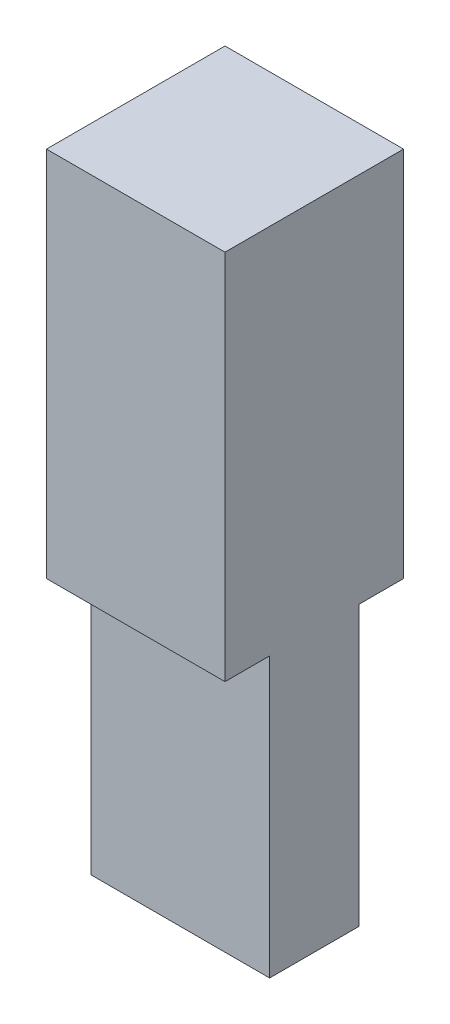
ISO-10303-21;
HEADER;
FILE_DESCRIPTION(('STEP AP214'),'2;1');
FILE_NAME('part.step','',(''),(''),'','','');
FILE_SCHEMA(('AUTOMOTIVE_DESIGN { 1 0 10303 214 1 1 1 1 }'));
ENDSEC;
DATA;
#1=APPLICATION_CONTEXT('core data for automotive mechanical design processes');
#2=APPLICATION_PROTOCOL_DEFINITION('international standard','automotive_design',2000,#1);
#3=PRODUCT_CONTEXT('',#1,'mechanical');
#4=PRODUCT('Part','Part','',(#3));
#5=PRODUCT_RELATED_PRODUCT_CATEGORY('part','',(#4));
#6=PRODUCT_DEFINITION_FORMATION('','',#4);
#7=PRODUCT_DEFINITION_CONTEXT('part definition',#1,'design');
#8=PRODUCT_DEFINITION('design','',#6,#7);
#9=PRODUCT_DEFINITION_SHAPE('','',#8);
#10=(LENGTH_UNIT() NAMED_UNIT(*) SI_UNIT(.MILLI.,.METRE.));
#11=(NAMED_UNIT(*) PLANE_ANGLE_UNIT() SI_UNIT($,.RADIAN.));
#12=(NAMED_UNIT(*) SI_UNIT($,.STERADIAN.) SOLID_ANGLE_UNIT());
#13=UNCERTAINTY_MEASURE_WITH_UNIT(LENGTH_MEASURE(1.E-05),#10,'distance_accuracy_value','');
#14=(GEOMETRIC_REPRESENTATION_CONTEXT(3) GLOBAL_UNCERTAINTY_ASSIGNED_CONTEXT((#13)) GLOBAL_UNIT_ASSIGNED_CONTEXT((#10,
#11,#12)) REPRESENTATION_CONTEXT('',''));
#15=CARTESIAN_POINT('',(0.,0.,0.));
#16=DIRECTION('',(0.,0.,1.));
#17=DIRECTION('',(1.,0.,0.));
#18=AXIS2_PLACEMENT_3D('',#15,#16,#17);
#19=CARTESIAN_POINT('',(6.096,9.525,-1.524));
#20=DIRECTION('',(0.,0.,1.));
#21=DIRECTION('',(0.,-1.,0.));
#22=AXIS2_PLACEMENT_3D('',#19,#20,#21);
#23=PLANE('',#22);
#24=DIRECTION('',(0.,1.,0.));
#25=VECTOR('',#24,1.);
#26=CARTESIAN_POINT('',(0.,9.525,-1.524));
#27=LINE('',#26,#25);
#28=CARTESIAN_POINT('',(0.,0.,-1.524));
#29=VERTEX_POINT('',#28);
#30=CARTESIAN_POINT('',(0.,9.525,-1.524));
#31=VERTEX_POINT('',#30);
#32=EDGE_CURVE('E144',#29,#31,#27,.T.);
#33=ORIENTED_EDGE('',*,*,#32,.T.);
#34=DIRECTION('',(-1.,0.,0.));
#35=VECTOR('',#34,1.);
#36=CARTESIAN_POINT('',(6.096,9.525,-1.524));
#37=LINE('',#36,#35);
#38=CARTESIAN_POINT('',(6.096,9.525,-1.524));
#39=VERTEX_POINT('',#38);
#40=EDGE_CURVE('E48',#39,#31,#37,.T.);
#41=ORIENTED_EDGE('',*,*,#40,.F.);
#42=DIRECTION('',(0.,1.,0.));
#43=VECTOR('',#42,1.);
#44=CARTESIAN_POINT('',(6.096,9.525,-1.524));
#45=LINE('',#44,#43);
#46=CARTESIAN_POINT('',(6.096,0.,-1.524));
#47=VERTEX_POINT('',#46);
#48=EDGE_CURVE('E100',#47,#39,#45,.T.);
#49=ORIENTED_EDGE('',*,*,#48,.F.);
#50=DIRECTION('',(-1.,0.,0.));
#51=VECTOR('',#50,1.);
#52=CARTESIAN_POINT('',(6.096,0.,-1.524));
#53=LINE('',#52,#51);
#54=EDGE_CURVE('E11',#47,#29,#53,.T.);
#55=ORIENTED_EDGE('',*,*,#54,.T.);
#56=EDGE_LOOP('',(#33,#41,#49,#55));
#57=FACE_BOUND('',#56,.T.);
#58=ADVANCED_FACE('F39',(#57),#23,.F.);
#59=CARTESIAN_POINT('',(6.096,9.525,-3.048));
#60=DIRECTION('',(0.,1.,0.));
#61=DIRECTION('',(0.,0.,1.));
#62=AXIS2_PLACEMENT_3D('',#59,#60,#61);
#63=PLANE('',#62);
#64=DIRECTION('',(0.,0.,-1.));
#65=VECTOR('',#64,1.);
#66=CARTESIAN_POINT('',(0.,9.525,-3.048));
#67=LINE('',#66,#65);
#68=CARTESIAN_POINT('',(0.,9.525,-3.048));
#69=VERTEX_POINT('',#68);
#70=EDGE_CURVE('E147',#31,#69,#67,.T.);
#71=ORIENTED_EDGE('',*,*,#70,.T.);
#72=DIRECTION('',(-1.,0.,0.));
#73=VECTOR('',#72,1.);
#74=CARTESIAN_POINT('',(6.096,9.525,-3.048));
#75=LINE('',#74,#73);
#76=CARTESIAN_POINT('',(6.096,9.525,-3.048));
#77=VERTEX_POINT('',#76);
#78=EDGE_CURVE('E175',#77,#69,#75,.T.);
#79=ORIENTED_EDGE('',*,*,#78,.F.);
#80=DIRECTION('',(0.,0.,-1.));
#81=VECTOR('',#80,1.);
#82=CARTESIAN_POINT('',(6.096,9.525,-3.048));
#83=LINE('',#82,#81);
#84=EDGE_CURVE('E185',#39,#77,#83,.T.);
#85=ORIENTED_EDGE('',*,*,#84,.F.);
#86=ORIENTED_EDGE('',*,*,#40,.T.);
#87=EDGE_LOOP('',(#71,#79,#85,#86));
#88=FACE_BOUND('',#87,.T.);
#89=ADVANCED_FACE('F183',(#88),#63,.F.);
#90=CARTESIAN_POINT('',(6.096,22.225,-3.048));
#91=DIRECTION('',(0.,0.,1.));
#92=DIRECTION('',(0.,-1.,0.));
#93=AXIS2_PLACEMENT_3D('',#90,#91,#92);
#94=PLANE('',#93);
#95=DIRECTION('',(0.,1.,0.));
#96=VECTOR('',#95,1.);
#97=CARTESIAN_POINT('',(0.,22.225,-3.048));
#98=LINE('',#97,#96);
#99=CARTESIAN_POINT('',(0.,22.225,-3.048));
#100=VERTEX_POINT('',#99);
#101=EDGE_CURVE('E150',#69,#100,#98,.T.);
#102=ORIENTED_EDGE('',*,*,#101,.T.);
#103=DIRECTION('',(-1.,0.,0.));
#104=VECTOR('',#103,1.);
#105=CARTESIAN_POINT('',(6.096,22.225,-3.048));
#106=LINE('',#105,#104);
#107=CARTESIAN_POINT('',(6.096,22.225,-3.048));
#108=VERTEX_POINT('',#107);
#109=EDGE_CURVE('E171',#108,#100,#106,.T.);
#110=ORIENTED_EDGE('',*,*,#109,.F.);
#111=DIRECTION('',(0.,1.,0.));
#112=VECTOR('',#111,1.);
#113=CARTESIAN_POINT('',(6.096,22.225,-3.048));
#114=LINE('',#113,#112);
#115=EDGE_CURVE('E199',#77,#108,#114,.T.);
#116=ORIENTED_EDGE('',*,*,#115,.F.);
#117=ORIENTED_EDGE('',*,*,#78,.T.);
#118=EDGE_LOOP('',(#102,#110,#116,#117));
#119=FACE_BOUND('',#118,.T.);
#120=ADVANCED_FACE('F194',(#119),#94,.F.);
#121=CARTESIAN_POINT('',(6.096,22.225,3.048));
#122=DIRECTION('',(0.,-1.,0.));
#123=DIRECTION('',(0.,0.,-1.));
#124=AXIS2_PLACEMENT_3D('',#121,#122,#123);
#125=PLANE('',#124);
#126=DIRECTION('',(0.,0.,1.));
#127=VECTOR('',#126,1.);
#128=CARTESIAN_POINT('',(0.,22.225,3.048));
#129=LINE('',#128,#127);
#130=CARTESIAN_POINT('',(0.,22.225,3.048));
#131=VERTEX_POINT('',#130);
#132=EDGE_CURVE('E153',#100,#131,#129,.T.);
#133=ORIENTED_EDGE('',*,*,#132,.T.);
#134=DIRECTION('',(-1.,0.,0.));
#135=VECTOR('',#134,1.);
#136=CARTESIAN_POINT('',(6.096,22.225,3.048));
#137=LINE('',#136,#135);
#138=CARTESIAN_POINT('',(6.096,22.225,3.048));
#139=VERTEX_POINT('',#138);
#140=EDGE_CURVE('E131',#139,#131,#137,.T.);
#141=ORIENTED_EDGE('',*,*,#140,.F.);
#142=DIRECTION('',(0.,0.,1.));
#143=VECTOR('',#142,1.);
#144=CARTESIAN_POINT('',(6.096,22.225,3.048));
#145=LINE('',#144,#143);
#146=EDGE_CURVE('E120',#108,#139,#145,.T.);
#147=ORIENTED_EDGE('',*,*,#146,.F.);
#148=ORIENTED_EDGE('',*,*,#109,.T.);
#149=EDGE_LOOP('',(#133,#141,#147,#148));
#150=FACE_BOUND('',#149,.T.);
#151=ADVANCED_FACE('F197',(#150),#125,.F.);
#152=CARTESIAN_POINT('',(6.096,9.525,3.048));
#153=DIRECTION('',(0.,0.,-1.));
#154=DIRECTION('',(-1.,0.,0.));
#155=AXIS2_PLACEMENT_3D('',#152,#153,#154);
#156=PLANE('',#155);
#157=DIRECTION('',(0.,-1.,0.));
#158=VECTOR('',#157,1.);
#159=CARTESIAN_POINT('',(0.,9.525,3.048));
#160=LINE('',#159,#158);
#161=CARTESIAN_POINT('',(0.,9.525,3.048));
#162=VERTEX_POINT('',#161);
#163=EDGE_CURVE('E129',#131,#162,#160,.T.);
#164=ORIENTED_EDGE('',*,*,#163,.T.);
#165=DIRECTION('',(-1.,0.,0.));
#166=VECTOR('',#165,1.);
#167=CARTESIAN_POINT('',(6.096,9.525,3.048));
#168=LINE('',#167,#166);
#169=CARTESIAN_POINT('',(6.096,9.525,3.048));
#170=VERTEX_POINT('',#169);
#171=EDGE_CURVE('E126',#170,#162,#168,.T.);
#172=ORIENTED_EDGE('',*,*,#171,.F.);
#173=DIRECTION('',(0.,-1.,0.));
#174=VECTOR('',#173,1.);
#175=CARTESIAN_POINT('',(6.096,9.525,3.048));
#176=LINE('',#175,#174);
#177=EDGE_CURVE('E114',#139,#170,#176,.T.);
#178=ORIENTED_EDGE('',*,*,#177,.F.);
#179=ORIENTED_EDGE('',*,*,#140,.T.);
#180=EDGE_LOOP('',(#164,#172,#178,#179));
#181=FACE_BOUND('',#180,.T.);
#182=ADVANCED_FACE('F127',(#181),#156,.F.);
#183=CARTESIAN_POINT('',(6.096,9.525,1.524));
#184=DIRECTION('',(0.,1.,0.));
#185=DIRECTION('',(0.,0.,1.));
#186=AXIS2_PLACEMENT_3D('',#183,#184,#185);
#187=PLANE('',#186);
#188=DIRECTION('',(0.,0.,-1.));
#189=VECTOR('',#188,1.);
#190=CARTESIAN_POINT('',(0.,9.525,1.524));
#191=LINE('',#190,#189);
#192=CARTESIAN_POINT('',(0.,9.525,1.524));
#193=VERTEX_POINT('',#192);
#194=EDGE_CURVE('E86',#162,#193,#191,.T.);
#195=ORIENTED_EDGE('',*,*,#194,.T.);
#196=DIRECTION('',(-1.,0.,0.));
#197=VECTOR('',#196,1.);
#198=CARTESIAN_POINT('',(6.096,9.525,1.524));
#199=LINE('',#198,#197);
#200=CARTESIAN_POINT('',(6.096,9.525,1.524));
#201=VERTEX_POINT('',#200);
#202=EDGE_CURVE('E132',#201,#193,#199,.T.);
#203=ORIENTED_EDGE('',*,*,#202,.F.);
#204=DIRECTION('',(0.,0.,-1.));
#205=VECTOR('',#204,1.);
#206=CARTESIAN_POINT('',(6.096,9.525,1.524));
#207=LINE('',#206,#205);
#208=EDGE_CURVE('E118',#170,#201,#207,.T.);
#209=ORIENTED_EDGE('',*,*,#208,.F.);
#210=ORIENTED_EDGE('',*,*,#171,.T.);
#211=EDGE_LOOP('',(#195,#203,#209,#210));
#212=FACE_BOUND('',#211,.T.);
#213=ADVANCED_FACE('F134',(#212),#187,.F.);
#214=CARTESIAN_POINT('',(6.096,0.,1.524));
#215=DIRECTION('',(0.,0.,-1.));
#216=DIRECTION('',(-1.,0.,0.));
#217=AXIS2_PLACEMENT_3D('',#214,#215,#216);
#218=PLANE('',#217);
#219=DIRECTION('',(0.,-1.,0.));
#220=VECTOR('',#219,1.);
#221=CARTESIAN_POINT('',(0.,0.,1.524));
#222=LINE('',#221,#220);
#223=CARTESIAN_POINT('',(0.,0.,1.524));
#224=VERTEX_POINT('',#223);
#225=EDGE_CURVE('E93',#193,#224,#222,.T.);
#226=ORIENTED_EDGE('',*,*,#225,.T.);
#227=DIRECTION('',(-1.,0.,0.));
#228=VECTOR('',#227,1.);
#229=CARTESIAN_POINT('',(6.096,0.,1.524));
#230=LINE('',#229,#228);
#231=CARTESIAN_POINT('',(6.096,0.,1.524));
#232=VERTEX_POINT('',#231);
#233=EDGE_CURVE('E140',#232,#224,#230,.T.);
#234=ORIENTED_EDGE('',*,*,#233,.F.);
#235=DIRECTION('',(0.,-1.,0.));
#236=VECTOR('',#235,1.);
#237=CARTESIAN_POINT('',(6.096,0.,1.524));
#238=LINE('',#237,#236);
#239=EDGE_CURVE('E137',#201,#232,#238,.T.);
#240=ORIENTED_EDGE('',*,*,#239,.F.);
#241=ORIENTED_EDGE('',*,*,#202,.T.);
#242=EDGE_LOOP('',(#226,#234,#240,#241));
#243=FACE_BOUND('',#242,.T.);
#244=ADVANCED_FACE('F224',(#243),#218,.F.);
#245=CARTESIAN_POINT('',(6.096,0.,0.));
#246=DIRECTION('',(0.,1.,0.));
#247=DIRECTION('',(0.,0.,1.));
#248=AXIS2_PLACEMENT_3D('',#245,#246,#247);
#249=PLANE('',#248);
#250=DIRECTION('',(0.,0.,-1.));
#251=VECTOR('',#250,1.);
#252=CARTESIAN_POINT('',(0.,0.,0.));
#253=LINE('',#252,#251);
#254=EDGE_CURVE('E162',#224,#29,#253,.T.);
#255=ORIENTED_EDGE('',*,*,#254,.T.);
#256=ORIENTED_EDGE('',*,*,#54,.F.);
#257=DIRECTION('',(0.,0.,-1.));
#258=VECTOR('',#257,1.);
#259=CARTESIAN_POINT('',(6.096,0.,-1.524));
#260=LINE('',#259,#258);
#261=EDGE_CURVE('E56',#232,#47,#260,.T.);
#262=ORIENTED_EDGE('',*,*,#261,.F.);
#263=ORIENTED_EDGE('',*,*,#233,.T.);
#264=EDGE_LOOP('',(#255,#256,#262,#263));
#265=FACE_BOUND('',#264,.T.);
#266=ADVANCED_FACE('F208',(#265),#249,.F.);
#267=CARTESIAN_POINT('',(6.096,0.,0.));
#268=DIRECTION('',(-1.,0.,0.));
#269=DIRECTION('',(0.,0.,1.));
#270=AXIS2_PLACEMENT_3D('',#267,#268,#269);
#271=PLANE('',#270);
#272=ORIENTED_EDGE('',*,*,#261,.T.);
#273=ORIENTED_EDGE('',*,*,#48,.T.);
#274=ORIENTED_EDGE('',*,*,#84,.T.);
#275=ORIENTED_EDGE('',*,*,#115,.T.);
#276=ORIENTED_EDGE('',*,*,#146,.T.);
#277=ORIENTED_EDGE('',*,*,#177,.T.);
#278=ORIENTED_EDGE('',*,*,#208,.T.);
#279=ORIENTED_EDGE('',*,*,#239,.T.);
#280=EDGE_LOOP('',(#272,#273,#274,#275,#276,#277,#278,#279));
#281=FACE_BOUND('',#280,.T.);
#282=ADVANCED_FACE('F116',(#281),#271,.F.);
#283=CARTESIAN_POINT('',(0.,0.,0.));
#284=DIRECTION('',(-1.,0.,0.));
#285=DIRECTION('',(0.,0.,1.));
#286=AXIS2_PLACEMENT_3D('',#283,#284,#285);
#287=PLANE('',#286);
#288=ORIENTED_EDGE('',*,*,#32,.F.);
#289=ORIENTED_EDGE('',*,*,#254,.F.);
#290=ORIENTED_EDGE('',*,*,#225,.F.);
#291=ORIENTED_EDGE('',*,*,#194,.F.);
#292=ORIENTED_EDGE('',*,*,#163,.F.);
#293=ORIENTED_EDGE('',*,*,#132,.F.);
#294=ORIENTED_EDGE('',*,*,#101,.F.);
#295=ORIENTED_EDGE('',*,*,#70,.F.);
#296=EDGE_LOOP('',(#288,#289,#290,#291,#292,#293,#294,#295));
#297=FACE_BOUND('',#296,.T.);
#298=ADVANCED_FACE('F189',(#297),#287,.T.);
#299=CLOSED_SHELL('',(#58,#89,#120,#151,#182,#213,#244,#266,#282,#298));
#300=MANIFOLD_SOLID_BREP('B2',#299);
#301=ADVANCED_BREP_SHAPE_REPRESENTATION('',(#18,#300),#14);
#302=SHAPE_DEFINITION_REPRESENTATION(#9,#301);
ENDSEC;
END-ISO-10303-21;
